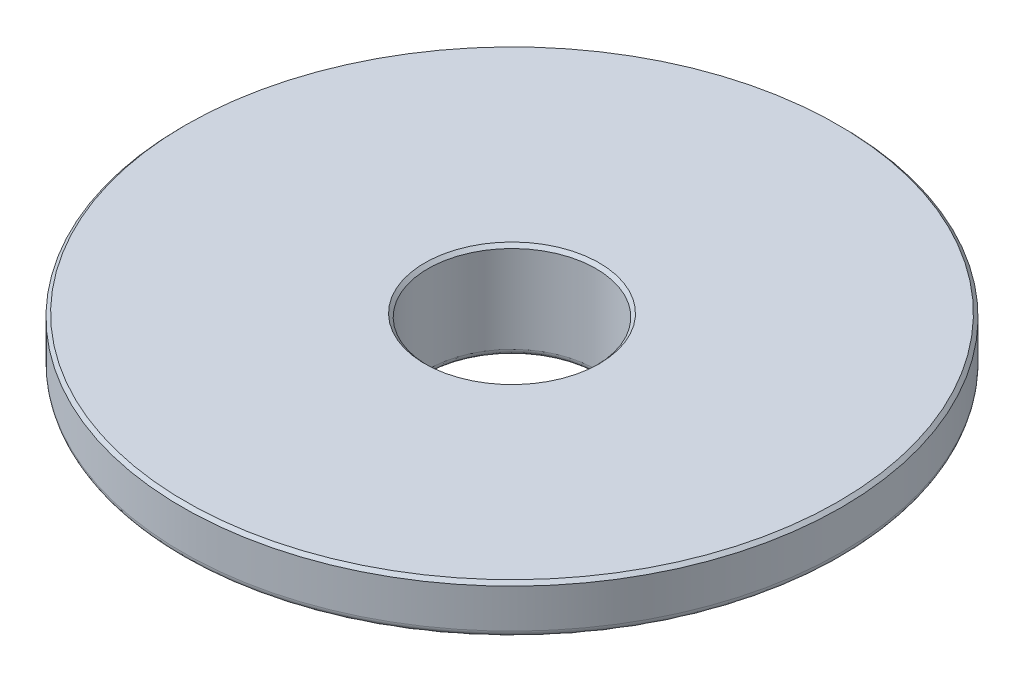
ISO-10303-21;
HEADER;
FILE_DESCRIPTION(('STEP AP214'),'2;1');
FILE_NAME('part.step','',(''),(''),'','','');
FILE_SCHEMA(('AUTOMOTIVE_DESIGN { 1 0 10303 214 1 1 1 1 }'));
ENDSEC;
DATA;
#1=APPLICATION_CONTEXT('core data for automotive mechanical design processes');
#2=APPLICATION_PROTOCOL_DEFINITION('international standard','automotive_design',2000,#1);
#3=PRODUCT_CONTEXT('',#1,'mechanical');
#4=PRODUCT('Part','Part','',(#3));
#5=PRODUCT_RELATED_PRODUCT_CATEGORY('part','',(#4));
#6=PRODUCT_DEFINITION_FORMATION('','',#4);
#7=PRODUCT_DEFINITION_CONTEXT('part definition',#1,'design');
#8=PRODUCT_DEFINITION('design','',#6,#7);
#9=PRODUCT_DEFINITION_SHAPE('','',#8);
#10=(LENGTH_UNIT() NAMED_UNIT(*) SI_UNIT(.MILLI.,.METRE.));
#11=(NAMED_UNIT(*) PLANE_ANGLE_UNIT() SI_UNIT($,.RADIAN.));
#12=(NAMED_UNIT(*) SI_UNIT($,.STERADIAN.) SOLID_ANGLE_UNIT());
#13=UNCERTAINTY_MEASURE_WITH_UNIT(LENGTH_MEASURE(1.E-05),#10,'distance_accuracy_value','');
#14=(GEOMETRIC_REPRESENTATION_CONTEXT(3) GLOBAL_UNCERTAINTY_ASSIGNED_CONTEXT((#13)) GLOBAL_UNIT_ASSIGNED_CONTEXT((#10,
#11,#12)) REPRESENTATION_CONTEXT('',''));
#15=CARTESIAN_POINT('',(0.,0.,0.));
#16=DIRECTION('',(0.,0.,1.));
#17=DIRECTION('',(1.,0.,0.));
#18=AXIS2_PLACEMENT_3D('',#15,#16,#17);
#19=CARTESIAN_POINT('',(0.,-73.6727,0.));
#20=DIRECTION('',(0.,1.,0.));
#21=DIRECTION('',(-1.,0.,0.));
#22=AXIS2_PLACEMENT_3D('',#19,#20,#21);
#23=CYLINDRICAL_SURFACE('',#22,6.47699999999999);
#24=CARTESIAN_POINT('',(0.,-72.5306964369884,0.));
#25=DIRECTION('',(0.,-1.,0.));
#26=DIRECTION('',(1.,0.,0.));
#27=AXIS2_PLACEMENT_3D('',#24,#25,#26);
#28=CIRCLE('',#27,6.47699999999999);
#29=CARTESIAN_POINT('',(6.477,-72.5306964369884,0.));
#30=VERTEX_POINT('',#29);
#31=EDGE_CURVE('E50',#30,#30,#28,.T.);
#32=ORIENTED_EDGE('',*,*,#31,.T.);
#33=EDGE_LOOP('',(#32));
#34=FACE_BOUND('',#33,.T.);
#35=CARTESIAN_POINT('',(0.,-65.7987,0.));
#36=DIRECTION('',(0.,-1.,0.));
#37=DIRECTION('',(1.,0.,0.));
#38=AXIS2_PLACEMENT_3D('',#35,#36,#37);
#39=CIRCLE('',#38,6.47699999999999);
#40=CARTESIAN_POINT('',(6.477,-65.7987,0.));
#41=VERTEX_POINT('',#40);
#42=EDGE_CURVE('E56',#41,#41,#39,.F.);
#43=ORIENTED_EDGE('',*,*,#42,.T.);
#44=EDGE_LOOP('',(#43));
#45=FACE_BOUND('',#44,.T.);
#46=ADVANCED_FACE('F30',(#34,#45),#23,.F.);
#47=CARTESIAN_POINT('',(0.,0.,0.));
#48=DIRECTION('',(0.,1.,0.));
#49=DIRECTION('',(1.,0.,0.));
#50=AXIS2_PLACEMENT_3D('',#47,#48,#49);
#51=SPHERICAL_SURFACE('',#50,73.6727);
#52=CARTESIAN_POINT('',(0.,-71.1419124054061,0.));
#53=DIRECTION('',(0.,1.,0.));
#54=DIRECTION('',(0.,0.,1.));
#55=AXIS2_PLACEMENT_3D('',#52,#53,#54);
#56=CIRCLE('',#55,19.1440597729824);
#57=CARTESIAN_POINT('',(0.,-71.1419124054061,19.1440597729824));
#58=VERTEX_POINT('',#57);
#59=EDGE_CURVE('E37',#58,#58,#56,.T.);
#60=ORIENTED_EDGE('',*,*,#59,.T.);
#61=EDGE_LOOP('',(#60));
#62=FACE_BOUND('',#61,.T.);
#63=CARTESIAN_POINT('',(0.,-69.2778533655034,0.));
#64=DIRECTION('',(0.,1.,0.));
#65=DIRECTION('',(-1.,0.,0.));
#66=AXIS2_PLACEMENT_3D('',#63,#64,#65);
#67=CIRCLE('',#66,25.0648311057108);
#68=CARTESIAN_POINT('',(-25.0648311057108,-69.2778533655034,0.));
#69=VERTEX_POINT('',#68);
#70=EDGE_CURVE('E41',#69,#69,#67,.F.);
#71=ORIENTED_EDGE('',*,*,#70,.T.);
#72=EDGE_LOOP('',(#71));
#73=FACE_BOUND('',#72,.T.);
#74=ADVANCED_FACE('F89',(#62,#73),#51,.T.);
#75=CARTESIAN_POINT('',(6.477,-65.5447,0.));
#76=DIRECTION('',(0.,-1.,0.));
#77=DIRECTION('',(1.,0.,0.));
#78=AXIS2_PLACEMENT_3D('',#75,#76,#77);
#79=PLANE('',#78);
#80=CARTESIAN_POINT('',(0.,-65.5447,0.));
#81=DIRECTION('',(0.,-1.,0.));
#82=DIRECTION('',(1.,0.,0.));
#83=AXIS2_PLACEMENT_3D('',#80,#81,#82);
#84=CIRCLE('',#83,25.146);
#85=CARTESIAN_POINT('',(25.146,-65.5447,0.));
#86=VERTEX_POINT('',#85);
#87=EDGE_CURVE('E62',#86,#86,#84,.F.);
#88=ORIENTED_EDGE('',*,*,#87,.T.);
#89=EDGE_LOOP('',(#88));
#90=FACE_BOUND('',#89,.T.);
#91=CARTESIAN_POINT('',(0.,-65.5447,0.));
#92=DIRECTION('',(0.,-1.,0.));
#93=DIRECTION('',(1.,0.,0.));
#94=AXIS2_PLACEMENT_3D('',#91,#92,#93);
#95=CIRCLE('',#94,6.73099999999997);
#96=CARTESIAN_POINT('',(6.73099999999999,-65.5447,0.));
#97=VERTEX_POINT('',#96);
#98=EDGE_CURVE('E65',#97,#97,#95,.T.);
#99=ORIENTED_EDGE('',*,*,#98,.T.);
#100=EDGE_LOOP('',(#99));
#101=FACE_BOUND('',#100,.T.);
#102=ADVANCED_FACE('F95',(#90,#101),#79,.F.);
#103=CARTESIAN_POINT('',(0.,-73.6727,0.));
#104=DIRECTION('',(0.,1.,0.));
#105=DIRECTION('',(-1.,0.,0.));
#106=AXIS2_PLACEMENT_3D('',#103,#104,#105);
#107=CYLINDRICAL_SURFACE('',#106,25.4);
#108=CARTESIAN_POINT('',(0.,-68.8001574277996,0.));
#109=DIRECTION('',(0.,1.,0.));
#110=DIRECTION('',(-1.,0.,0.));
#111=AXIS2_PLACEMENT_3D('',#108,#109,#110);
#112=CIRCLE('',#111,25.4);
#113=CARTESIAN_POINT('',(-25.3999999999999,-68.8001574277995,0.));
#114=VERTEX_POINT('',#113);
#115=EDGE_CURVE('E45',#114,#114,#112,.T.);
#116=ORIENTED_EDGE('',*,*,#115,.T.);
#117=EDGE_LOOP('',(#116));
#118=FACE_BOUND('',#117,.T.);
#119=CARTESIAN_POINT('',(0.,-65.7987,0.));
#120=DIRECTION('',(0.,-1.,0.));
#121=DIRECTION('',(1.,0.,0.));
#122=AXIS2_PLACEMENT_3D('',#119,#120,#121);
#123=CIRCLE('',#122,25.4);
#124=CARTESIAN_POINT('',(25.4,-65.7987,0.));
#125=VERTEX_POINT('',#124);
#126=EDGE_CURVE('E59',#125,#125,#123,.T.);
#127=ORIENTED_EDGE('',*,*,#126,.T.);
#128=EDGE_LOOP('',(#127));
#129=FACE_BOUND('',#128,.T.);
#130=ADVANCED_FACE('F86',(#118,#129),#107,.T.);
#131=CARTESIAN_POINT('',(0.,0.,0.));
#132=DIRECTION('',(0.,1.,0.));
#133=DIRECTION('',(0.,0.,1.));
#134=AXIS2_PLACEMENT_3D('',#131,#132,#133);
#135=CYLINDRICAL_SURFACE('',#134,18.9840584632548);
#136=CARTESIAN_POINT('',(0.,-71.019275080108,0.));
#137=DIRECTION('',(0.,1.,0.));
#138=DIRECTION('',(0.,0.,1.));
#139=AXIS2_PLACEMENT_3D('',#136,#137,#138);
#140=CIRCLE('',#139,18.9840584632548);
#141=CARTESIAN_POINT('',(0.,-71.019275080108,18.9840584632548));
#142=VERTEX_POINT('',#141);
#143=EDGE_CURVE('E10',#142,#142,#140,.F.);
#144=ORIENTED_EDGE('',*,*,#143,.T.);
#145=EDGE_LOOP('',(#144));
#146=FACE_BOUND('',#145,.T.);
#147=CARTESIAN_POINT('',(0.,-70.9307754056562,0.));
#148=DIRECTION('',(0.,1.,0.));
#149=DIRECTION('',(0.,0.,1.));
#150=AXIS2_PLACEMENT_3D('',#147,#148,#149);
#151=CIRCLE('',#150,18.9840584632548);
#152=CARTESIAN_POINT('',(0.,-70.9307754056562,18.9840584632548));
#153=VERTEX_POINT('',#152);
#154=EDGE_CURVE('E68',#153,#153,#151,.T.);
#155=ORIENTED_EDGE('',*,*,#154,.T.);
#156=EDGE_LOOP('',(#155));
#157=FACE_BOUND('',#156,.T.);
#158=ADVANCED_FACE('F72',(#146,#157),#135,.F.);
#159=CARTESIAN_POINT('',(0.,-70.9307754056562,0.));
#160=DIRECTION('',(0.,1.,0.));
#161=DIRECTION('',(0.,0.,1.));
#162=AXIS2_PLACEMENT_3D('',#159,#160,#161);
#163=CONICAL_SURFACE('',#162,18.9840584632548,1.39626340159546);
#164=CARTESIAN_POINT('',(0.,-73.0309787755186,0.));
#165=DIRECTION('',(0.,1.,0.));
#166=DIRECTION('',(0.,0.,1.));
#167=AXIS2_PLACEMENT_3D('',#164,#165,#166);
#168=CIRCLE('',#167,7.07321327425479);
#169=CARTESIAN_POINT('',(0.,-73.0309787755186,7.07321327425479));
#170=VERTEX_POINT('',#169);
#171=EDGE_CURVE('E53',#170,#170,#168,.T.);
#172=ORIENTED_EDGE('',*,*,#171,.T.);
#173=EDGE_LOOP('',(#172));
#174=FACE_BOUND('',#173,.T.);
#175=ORIENTED_EDGE('',*,*,#154,.F.);
#176=EDGE_LOOP('',(#175));
#177=FACE_BOUND('',#176,.T.);
#178=ADVANCED_FACE('F74',(#174,#177),#163,.T.);
#179=CARTESIAN_POINT('',(0.,-65.5447,0.));
#180=DIRECTION('',(0.,-1.,0.));
#181=DIRECTION('',(1.,0.,0.));
#182=AXIS2_PLACEMENT_3D('',#179,#180,#181);
#183=CONICAL_SURFACE('',#182,25.146,0.785398163397448);
#184=ORIENTED_EDGE('',*,*,#126,.F.);
#185=EDGE_LOOP('',(#184));
#186=FACE_BOUND('',#185,.T.);
#187=ORIENTED_EDGE('',*,*,#87,.F.);
#188=EDGE_LOOP('',(#187));
#189=FACE_BOUND('',#188,.T.);
#190=ADVANCED_FACE('F76',(#186,#189),#183,.T.);
#191=CARTESIAN_POINT('',(0.,-65.7987,0.));
#192=DIRECTION('',(0.,1.,0.));
#193=DIRECTION('',(-1.,0.,0.));
#194=AXIS2_PLACEMENT_3D('',#191,#192,#193);
#195=CONICAL_SURFACE('',#194,6.47699999999999,0.785398163397455);
#196=ORIENTED_EDGE('',*,*,#98,.F.);
#197=EDGE_LOOP('',(#196));
#198=FACE_BOUND('',#197,.T.);
#199=ORIENTED_EDGE('',*,*,#42,.F.);
#200=EDGE_LOOP('',(#199));
#201=FACE_BOUND('',#200,.T.);
#202=ADVANCED_FACE('F83',(#198,#201),#195,.F.);
#203=CARTESIAN_POINT('',(0.,-72.5306964369884,0.));
#204=DIRECTION('',(0.,-1.,0.));
#205=DIRECTION('',(1.,0.,0.));
#206=AXIS2_PLACEMENT_3D('',#203,#204,#205);
#207=TOROIDAL_SURFACE('',#206,6.98499999999999,0.508);
#208=ORIENTED_EDGE('',*,*,#31,.F.);
#209=EDGE_LOOP('',(#208));
#210=FACE_BOUND('',#209,.T.);
#211=ORIENTED_EDGE('',*,*,#171,.F.);
#212=EDGE_LOOP('',(#211));
#213=FACE_BOUND('',#212,.T.);
#214=ADVANCED_FACE('F105',(#210,#213),#207,.T.);
#215=CARTESIAN_POINT('',(0.,-68.8001574277996,0.));
#216=DIRECTION('',(0.,1.,0.));
#217=DIRECTION('',(-1.,0.,0.));
#218=AXIS2_PLACEMENT_3D('',#215,#216,#217);
#219=TOROIDAL_SURFACE('',#218,24.892,0.508);
#220=ORIENTED_EDGE('',*,*,#70,.F.);
#221=EDGE_LOOP('',(#220));
#222=FACE_BOUND('',#221,.T.);
#223=ORIENTED_EDGE('',*,*,#115,.F.);
#224=EDGE_LOOP('',(#223));
#225=FACE_BOUND('',#224,.T.);
#226=ADVANCED_FACE('F108',(#222,#225),#219,.T.);
#227=CARTESIAN_POINT('',(0.,-71.019275080108,0.));
#228=DIRECTION('',(0.,1.,0.));
#229=DIRECTION('',(0.,0.,1.));
#230=AXIS2_PLACEMENT_3D('',#227,#228,#229);
#231=TOROIDAL_SURFACE('',#230,19.1110584632548,0.127);
#232=ORIENTED_EDGE('',*,*,#143,.F.);
#233=EDGE_LOOP('',(#232));
#234=FACE_BOUND('',#233,.T.);
#235=ORIENTED_EDGE('',*,*,#59,.F.);
#236=EDGE_LOOP('',(#235));
#237=FACE_BOUND('',#236,.T.);
#238=ADVANCED_FACE('F32',(#234,#237),#231,.T.);
#239=CLOSED_SHELL('',(#46,#74,#102,#130,#158,#178,#190,#202,#214,#226,#238));
#240=MANIFOLD_SOLID_BREP('B2',#239);
#241=ADVANCED_BREP_SHAPE_REPRESENTATION('',(#18,#240),#14);
#242=SHAPE_DEFINITION_REPRESENTATION(#9,#241);
ENDSEC;
END-ISO-10303-21;
